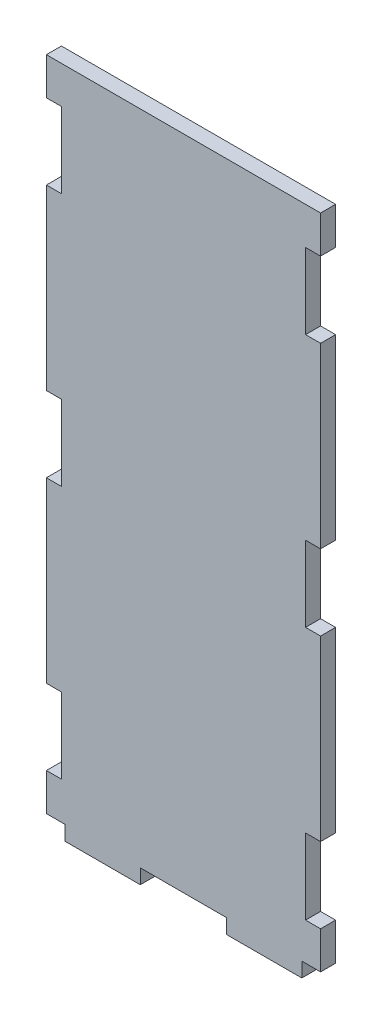
ISO-10303-21;
HEADER;
FILE_DESCRIPTION(('STEP AP214'),'2;1');
FILE_NAME('part.step','',(''),(''),'','','');
FILE_SCHEMA(('AUTOMOTIVE_DESIGN { 1 0 10303 214 1 1 1 1 }'));
ENDSEC;
DATA;
#1=APPLICATION_CONTEXT('core data for automotive mechanical design processes');
#2=APPLICATION_PROTOCOL_DEFINITION('international standard','automotive_design',2000,#1);
#3=PRODUCT_CONTEXT('',#1,'mechanical');
#4=PRODUCT('Part','Part','',(#3));
#5=PRODUCT_RELATED_PRODUCT_CATEGORY('part','',(#4));
#6=PRODUCT_DEFINITION_FORMATION('','',#4);
#7=PRODUCT_DEFINITION_CONTEXT('part definition',#1,'design');
#8=PRODUCT_DEFINITION('design','',#6,#7);
#9=PRODUCT_DEFINITION_SHAPE('','',#8);
#10=(LENGTH_UNIT() NAMED_UNIT(*) SI_UNIT(.MILLI.,.METRE.));
#11=(NAMED_UNIT(*) PLANE_ANGLE_UNIT() SI_UNIT($,.RADIAN.));
#12=(NAMED_UNIT(*) SI_UNIT($,.STERADIAN.) SOLID_ANGLE_UNIT());
#13=UNCERTAINTY_MEASURE_WITH_UNIT(LENGTH_MEASURE(1.E-05),#10,'distance_accuracy_value','');
#14=(GEOMETRIC_REPRESENTATION_CONTEXT(3) GLOBAL_UNCERTAINTY_ASSIGNED_CONTEXT((#13)) GLOBAL_UNIT_ASSIGNED_CONTEXT((#10,
#11,#12)) REPRESENTATION_CONTEXT('',''));
#15=CARTESIAN_POINT('',(0.,0.,0.));
#16=DIRECTION('',(0.,0.,1.));
#17=DIRECTION('',(1.,0.,0.));
#18=AXIS2_PLACEMENT_3D('',#15,#16,#17);
#19=CARTESIAN_POINT('',(0.,77.45,4.));
#20=DIRECTION('',(0.,1.,0.));
#21=DIRECTION('',(0.,0.,1.));
#22=AXIS2_PLACEMENT_3D('',#19,#20,#21);
#23=PLANE('',#22);
#24=DIRECTION('',(1.,0.,0.));
#25=VECTOR('',#24,1.);
#26=CARTESIAN_POINT('',(0.,77.45,0.));
#27=LINE('',#26,#25);
#28=CARTESIAN_POINT('',(-4.,77.45,0.));
#29=VERTEX_POINT('',#28);
#30=CARTESIAN_POINT('',(0.,77.45,0.));
#31=VERTEX_POINT('',#30);
#32=EDGE_CURVE('E303',#29,#31,#27,.T.);
#33=ORIENTED_EDGE('',*,*,#32,.F.);
#34=DIRECTION('',(0.,0.,-1.));
#35=VECTOR('',#34,1.);
#36=CARTESIAN_POINT('',(-4.,77.45,4.));
#37=LINE('',#36,#35);
#38=CARTESIAN_POINT('',(-4.,77.45,4.));
#39=VERTEX_POINT('',#38);
#40=EDGE_CURVE('E11',#39,#29,#37,.T.);
#41=ORIENTED_EDGE('',*,*,#40,.F.);
#42=DIRECTION('',(1.,0.,0.));
#43=VECTOR('',#42,1.);
#44=CARTESIAN_POINT('',(0.,77.45,4.));
#45=LINE('',#44,#43);
#46=CARTESIAN_POINT('',(0.,77.45,4.));
#47=VERTEX_POINT('',#46);
#48=EDGE_CURVE('E627',#39,#47,#45,.T.);
#49=ORIENTED_EDGE('',*,*,#48,.T.);
#50=DIRECTION('',(0.,0.,-1.));
#51=VECTOR('',#50,1.);
#52=CARTESIAN_POINT('',(0.,77.45,4.));
#53=LINE('',#52,#51);
#54=EDGE_CURVE('E176',#47,#31,#53,.T.);
#55=ORIENTED_EDGE('',*,*,#54,.T.);
#56=EDGE_LOOP('',(#33,#41,#49,#55));
#57=FACE_BOUND('',#56,.T.);
#58=ADVANCED_FACE('F41',(#57),#23,.T.);
#59=CARTESIAN_POINT('',(-4.,0.,4.));
#60=DIRECTION('',(-1.,0.,0.));
#61=DIRECTION('',(0.,0.,1.));
#62=AXIS2_PLACEMENT_3D('',#59,#60,#61);
#63=PLANE('',#62);
#64=DIRECTION('',(0.,1.,0.));
#65=VECTOR('',#64,1.);
#66=CARTESIAN_POINT('',(-4.,0.,0.));
#67=LINE('',#66,#65);
#68=CARTESIAN_POINT('',(-4.,97.55,0.));
#69=VERTEX_POINT('',#68);
#70=EDGE_CURVE('E306',#29,#69,#67,.T.);
#71=ORIENTED_EDGE('',*,*,#70,.T.);
#72=DIRECTION('',(0.,0.,-1.));
#73=VECTOR('',#72,1.);
#74=CARTESIAN_POINT('',(-4.,97.55,4.));
#75=LINE('',#74,#73);
#76=CARTESIAN_POINT('',(-4.,97.55,4.));
#77=VERTEX_POINT('',#76);
#78=EDGE_CURVE('E49',#77,#69,#75,.T.);
#79=ORIENTED_EDGE('',*,*,#78,.F.);
#80=DIRECTION('',(0.,1.,0.));
#81=VECTOR('',#80,1.);
#82=CARTESIAN_POINT('',(-4.,0.,4.));
#83=LINE('',#82,#81);
#84=EDGE_CURVE('E477',#39,#77,#83,.T.);
#85=ORIENTED_EDGE('',*,*,#84,.F.);
#86=ORIENTED_EDGE('',*,*,#40,.T.);
#87=EDGE_LOOP('',(#71,#79,#85,#86));
#88=FACE_BOUND('',#87,.T.);
#89=ADVANCED_FACE('F621',(#88),#63,.F.);
#90=CARTESIAN_POINT('',(0.,97.55,4.));
#91=DIRECTION('',(0.,1.,0.));
#92=DIRECTION('',(0.,0.,1.));
#93=AXIS2_PLACEMENT_3D('',#90,#91,#92);
#94=PLANE('',#93);
#95=DIRECTION('',(1.,0.,0.));
#96=VECTOR('',#95,1.);
#97=CARTESIAN_POINT('',(0.,97.55,0.));
#98=LINE('',#97,#96);
#99=CARTESIAN_POINT('',(0.,97.55,0.));
#100=VERTEX_POINT('',#99);
#101=EDGE_CURVE('E308',#69,#100,#98,.T.);
#102=ORIENTED_EDGE('',*,*,#101,.T.);
#103=DIRECTION('',(0.,0.,-1.));
#104=VECTOR('',#103,1.);
#105=CARTESIAN_POINT('',(0.,97.55,4.));
#106=LINE('',#105,#104);
#107=CARTESIAN_POINT('',(0.,97.55,4.));
#108=VERTEX_POINT('',#107);
#109=EDGE_CURVE('E451',#108,#100,#106,.T.);
#110=ORIENTED_EDGE('',*,*,#109,.F.);
#111=DIRECTION('',(1.,0.,0.));
#112=VECTOR('',#111,1.);
#113=CARTESIAN_POINT('',(0.,97.55,4.));
#114=LINE('',#113,#112);
#115=EDGE_CURVE('E460',#77,#108,#114,.T.);
#116=ORIENTED_EDGE('',*,*,#115,.F.);
#117=ORIENTED_EDGE('',*,*,#78,.T.);
#118=EDGE_LOOP('',(#102,#110,#116,#117));
#119=FACE_BOUND('',#118,.T.);
#120=ADVANCED_FACE('F458',(#119),#94,.F.);
#121=CARTESIAN_POINT('',(0.,0.,4.));
#122=DIRECTION('',(-1.,0.,0.));
#123=DIRECTION('',(0.,0.,1.));
#124=AXIS2_PLACEMENT_3D('',#121,#122,#123);
#125=PLANE('',#124);
#126=DIRECTION('',(0.,1.,0.));
#127=VECTOR('',#126,1.);
#128=CARTESIAN_POINT('',(0.,0.,0.));
#129=LINE('',#128,#127);
#130=CARTESIAN_POINT('',(0.,144.95,0.));
#131=VERTEX_POINT('',#130);
#132=EDGE_CURVE('E310',#100,#131,#129,.T.);
#133=ORIENTED_EDGE('',*,*,#132,.T.);
#134=DIRECTION('',(0.,0.,-1.));
#135=VECTOR('',#134,1.);
#136=CARTESIAN_POINT('',(0.,144.95,4.));
#137=LINE('',#136,#135);
#138=CARTESIAN_POINT('',(0.,144.95,4.));
#139=VERTEX_POINT('',#138);
#140=EDGE_CURVE('E449',#139,#131,#137,.T.);
#141=ORIENTED_EDGE('',*,*,#140,.F.);
#142=DIRECTION('',(0.,1.,0.));
#143=VECTOR('',#142,1.);
#144=CARTESIAN_POINT('',(0.,0.,4.));
#145=LINE('',#144,#143);
#146=EDGE_CURVE('E300',#108,#139,#145,.T.);
#147=ORIENTED_EDGE('',*,*,#146,.F.);
#148=ORIENTED_EDGE('',*,*,#109,.T.);
#149=EDGE_LOOP('',(#133,#141,#147,#148));
#150=FACE_BOUND('',#149,.T.);
#151=ADVANCED_FACE('F469',(#150),#125,.F.);
#152=CARTESIAN_POINT('',(0.,144.95,4.));
#153=DIRECTION('',(0.,1.,0.));
#154=DIRECTION('',(0.,0.,1.));
#155=AXIS2_PLACEMENT_3D('',#152,#153,#154);
#156=PLANE('',#155);
#157=DIRECTION('',(1.,0.,0.));
#158=VECTOR('',#157,1.);
#159=CARTESIAN_POINT('',(0.,144.95,0.));
#160=LINE('',#159,#158);
#161=CARTESIAN_POINT('',(-4.00000000000002,144.95,0.));
#162=VERTEX_POINT('',#161);
#163=EDGE_CURVE('E313',#162,#131,#160,.T.);
#164=ORIENTED_EDGE('',*,*,#163,.F.);
#165=DIRECTION('',(0.,0.,-1.));
#166=VECTOR('',#165,1.);
#167=CARTESIAN_POINT('',(-4.00000000000002,144.95,4.));
#168=LINE('',#167,#166);
#169=CARTESIAN_POINT('',(-4.00000000000002,144.95,4.));
#170=VERTEX_POINT('',#169);
#171=EDGE_CURVE('E447',#170,#162,#168,.T.);
#172=ORIENTED_EDGE('',*,*,#171,.F.);
#173=DIRECTION('',(1.,0.,0.));
#174=VECTOR('',#173,1.);
#175=CARTESIAN_POINT('',(0.,144.95,4.));
#176=LINE('',#175,#174);
#177=EDGE_CURVE('E473',#170,#139,#176,.T.);
#178=ORIENTED_EDGE('',*,*,#177,.T.);
#179=ORIENTED_EDGE('',*,*,#140,.T.);
#180=EDGE_LOOP('',(#164,#172,#178,#179));
#181=FACE_BOUND('',#180,.T.);
#182=ADVANCED_FACE('F642',(#181),#156,.T.);
#183=CARTESIAN_POINT('',(-3.99999999999998,0.,4.));
#184=DIRECTION('',(1.,0.,0.));
#185=DIRECTION('',(0.,1.,0.));
#186=AXIS2_PLACEMENT_3D('',#183,#184,#185);
#187=PLANE('',#186);
#188=DIRECTION('',(0.,-1.,0.));
#189=VECTOR('',#188,1.);
#190=CARTESIAN_POINT('',(-3.99999999999998,0.,0.));
#191=LINE('',#190,#189);
#192=CARTESIAN_POINT('',(-4.00000000000002,165.05,0.));
#193=VERTEX_POINT('',#192);
#194=EDGE_CURVE('E318',#193,#162,#191,.T.);
#195=ORIENTED_EDGE('',*,*,#194,.F.);
#196=DIRECTION('',(0.,0.,-1.));
#197=VECTOR('',#196,1.);
#198=CARTESIAN_POINT('',(-4.00000000000002,165.05,4.));
#199=LINE('',#198,#197);
#200=CARTESIAN_POINT('',(-4.00000000000002,165.05,4.));
#201=VERTEX_POINT('',#200);
#202=EDGE_CURVE('E445',#201,#193,#199,.T.);
#203=ORIENTED_EDGE('',*,*,#202,.F.);
#204=DIRECTION('',(0.,-1.,0.));
#205=VECTOR('',#204,1.);
#206=CARTESIAN_POINT('',(-3.99999999999998,0.,4.));
#207=LINE('',#206,#205);
#208=EDGE_CURVE('E475',#201,#170,#207,.T.);
#209=ORIENTED_EDGE('',*,*,#208,.T.);
#210=ORIENTED_EDGE('',*,*,#171,.T.);
#211=EDGE_LOOP('',(#195,#203,#209,#210));
#212=FACE_BOUND('',#211,.T.);
#213=ADVANCED_FACE('F664',(#212),#187,.T.);
#214=CARTESIAN_POINT('',(-1.14526443883989E-12,165.05,4.));
#215=DIRECTION('',(0.,1.,0.));
#216=DIRECTION('',(-1.,0.,0.));
#217=AXIS2_PLACEMENT_3D('',#214,#215,#216);
#218=PLANE('',#217);
#219=DIRECTION('',(1.,0.,0.));
#220=VECTOR('',#219,1.);
#221=CARTESIAN_POINT('',(-1.14526443883989E-12,165.05,0.));
#222=LINE('',#221,#220);
#223=CARTESIAN_POINT('',(0.,165.05,0.));
#224=VERTEX_POINT('',#223);
#225=EDGE_CURVE('E321',#193,#224,#222,.T.);
#226=ORIENTED_EDGE('',*,*,#225,.T.);
#227=DIRECTION('',(0.,0.,-1.));
#228=VECTOR('',#227,1.);
#229=CARTESIAN_POINT('',(0.,165.05,4.));
#230=LINE('',#229,#228);
#231=CARTESIAN_POINT('',(0.,165.05,4.));
#232=VERTEX_POINT('',#231);
#233=EDGE_CURVE('E442',#232,#224,#230,.T.);
#234=ORIENTED_EDGE('',*,*,#233,.F.);
#235=DIRECTION('',(1.,0.,0.));
#236=VECTOR('',#235,1.);
#237=CARTESIAN_POINT('',(-1.14526443883989E-12,165.05,4.));
#238=LINE('',#237,#236);
#239=EDGE_CURVE('E480',#201,#232,#238,.T.);
#240=ORIENTED_EDGE('',*,*,#239,.F.);
#241=ORIENTED_EDGE('',*,*,#202,.T.);
#242=EDGE_LOOP('',(#226,#234,#240,#241));
#243=FACE_BOUND('',#242,.T.);
#244=ADVANCED_FACE('F655',(#243),#218,.F.);
#245=CARTESIAN_POINT('',(0.,175.,0.));
#246=VERTEX_POINT('',#245);
#247=EDGE_CURVE('E315',#224,#246,#129,.T.);
#248=ORIENTED_EDGE('',*,*,#247,.T.);
#249=DIRECTION('',(0.,0.,-1.));
#250=VECTOR('',#249,1.);
#251=CARTESIAN_POINT('',(0.,175.,4.));
#252=LINE('',#251,#250);
#253=CARTESIAN_POINT('',(0.,175.,4.));
#254=VERTEX_POINT('',#253);
#255=EDGE_CURVE('E439',#254,#246,#252,.T.);
#256=ORIENTED_EDGE('',*,*,#255,.F.);
#257=EDGE_CURVE('E474',#232,#254,#145,.T.);
#258=ORIENTED_EDGE('',*,*,#257,.F.);
#259=ORIENTED_EDGE('',*,*,#233,.T.);
#260=EDGE_LOOP('',(#248,#256,#258,#259));
#261=FACE_BOUND('',#260,.T.);
#262=ADVANCED_FACE('F643',(#261),#125,.F.);
#263=CARTESIAN_POINT('',(0.,175.,4.));
#264=DIRECTION('',(0.,-1.,0.));
#265=DIRECTION('',(1.,0.,0.));
#266=AXIS2_PLACEMENT_3D('',#263,#264,#265);
#267=PLANE('',#266);
#268=DIRECTION('',(-1.,0.,0.));
#269=VECTOR('',#268,1.);
#270=CARTESIAN_POINT('',(0.,175.,0.));
#271=LINE('',#270,#269);
#272=CARTESIAN_POINT('',(-73.,175.,0.));
#273=VERTEX_POINT('',#272);
#274=EDGE_CURVE('E323',#246,#273,#271,.T.);
#275=ORIENTED_EDGE('',*,*,#274,.T.);
#276=DIRECTION('',(0.,0.,-1.));
#277=VECTOR('',#276,1.);
#278=CARTESIAN_POINT('',(-73.,175.,4.));
#279=LINE('',#278,#277);
#280=CARTESIAN_POINT('',(-73.,175.,4.));
#281=VERTEX_POINT('',#280);
#282=EDGE_CURVE('E437',#281,#273,#279,.T.);
#283=ORIENTED_EDGE('',*,*,#282,.F.);
#284=DIRECTION('',(-1.,0.,0.));
#285=VECTOR('',#284,1.);
#286=CARTESIAN_POINT('',(0.,175.,4.));
#287=LINE('',#286,#285);
#288=EDGE_CURVE('E479',#254,#281,#287,.T.);
#289=ORIENTED_EDGE('',*,*,#288,.F.);
#290=ORIENTED_EDGE('',*,*,#255,.T.);
#291=EDGE_LOOP('',(#275,#283,#289,#290));
#292=FACE_BOUND('',#291,.T.);
#293=ADVANCED_FACE('F654',(#292),#267,.F.);
#294=CARTESIAN_POINT('',(-73.,0.,4.));
#295=DIRECTION('',(-1.,0.,0.));
#296=DIRECTION('',(0.,-1.,0.));
#297=AXIS2_PLACEMENT_3D('',#294,#295,#296);
#298=PLANE('',#297);
#299=DIRECTION('',(0.,1.,0.));
#300=VECTOR('',#299,1.);
#301=CARTESIAN_POINT('',(-73.,0.,0.));
#302=LINE('',#301,#300);
#303=CARTESIAN_POINT('',(-73.,165.05,0.));
#304=VERTEX_POINT('',#303);
#305=EDGE_CURVE('E326',#304,#273,#302,.T.);
#306=ORIENTED_EDGE('',*,*,#305,.F.);
#307=DIRECTION('',(0.,0.,-1.));
#308=VECTOR('',#307,1.);
#309=CARTESIAN_POINT('',(-73.,165.05,4.));
#310=LINE('',#309,#308);
#311=CARTESIAN_POINT('',(-73.,165.05,4.));
#312=VERTEX_POINT('',#311);
#313=EDGE_CURVE('E435',#312,#304,#310,.T.);
#314=ORIENTED_EDGE('',*,*,#313,.F.);
#315=DIRECTION('',(0.,1.,0.));
#316=VECTOR('',#315,1.);
#317=CARTESIAN_POINT('',(-73.,0.,4.));
#318=LINE('',#317,#316);
#319=EDGE_CURVE('E483',#312,#281,#318,.T.);
#320=ORIENTED_EDGE('',*,*,#319,.T.);
#321=ORIENTED_EDGE('',*,*,#282,.T.);
#322=EDGE_LOOP('',(#306,#314,#320,#321));
#323=FACE_BOUND('',#322,.T.);
#324=ADVANCED_FACE('F661',(#323),#298,.T.);
#325=CARTESIAN_POINT('',(0.,165.05,4.));
#326=DIRECTION('',(0.,-1.,0.));
#327=DIRECTION('',(0.,0.,-1.));
#328=AXIS2_PLACEMENT_3D('',#325,#326,#327);
#329=PLANE('',#328);
#330=DIRECTION('',(-1.,0.,0.));
#331=VECTOR('',#330,1.);
#332=CARTESIAN_POINT('',(0.,165.05,0.));
#333=LINE('',#332,#331);
#334=CARTESIAN_POINT('',(-69.0000000000001,165.05,0.));
#335=VERTEX_POINT('',#334);
#336=EDGE_CURVE('E329',#335,#304,#333,.T.);
#337=ORIENTED_EDGE('',*,*,#336,.F.);
#338=DIRECTION('',(0.,0.,-1.));
#339=VECTOR('',#338,1.);
#340=CARTESIAN_POINT('',(-69.0000000000001,165.05,4.));
#341=LINE('',#340,#339);
#342=CARTESIAN_POINT('',(-69.0000000000001,165.05,4.));
#343=VERTEX_POINT('',#342);
#344=EDGE_CURVE('E433',#343,#335,#341,.T.);
#345=ORIENTED_EDGE('',*,*,#344,.F.);
#346=DIRECTION('',(-1.,0.,0.));
#347=VECTOR('',#346,1.);
#348=CARTESIAN_POINT('',(0.,165.05,4.));
#349=LINE('',#348,#347);
#350=EDGE_CURVE('E523',#343,#312,#349,.T.);
#351=ORIENTED_EDGE('',*,*,#350,.T.);
#352=ORIENTED_EDGE('',*,*,#313,.T.);
#353=EDGE_LOOP('',(#337,#345,#351,#352));
#354=FACE_BOUND('',#353,.T.);
#355=ADVANCED_FACE('F678',(#354),#329,.T.);
#356=CARTESIAN_POINT('',(-69.0000000000001,0.,4.));
#357=DIRECTION('',(1.,0.,0.));
#358=DIRECTION('',(0.,0.,-1.));
#359=AXIS2_PLACEMENT_3D('',#356,#357,#358);
#360=PLANE('',#359);
#361=DIRECTION('',(0.,-1.,0.));
#362=VECTOR('',#361,1.);
#363=CARTESIAN_POINT('',(-69.0000000000001,0.,0.));
#364=LINE('',#363,#362);
#365=CARTESIAN_POINT('',(-69.0000000000001,144.95,0.));
#366=VERTEX_POINT('',#365);
#367=EDGE_CURVE('E334',#335,#366,#364,.T.);
#368=ORIENTED_EDGE('',*,*,#367,.T.);
#369=DIRECTION('',(0.,0.,-1.));
#370=VECTOR('',#369,1.);
#371=CARTESIAN_POINT('',(-69.0000000000001,144.95,4.));
#372=LINE('',#371,#370);
#373=CARTESIAN_POINT('',(-69.0000000000001,144.95,4.));
#374=VERTEX_POINT('',#373);
#375=EDGE_CURVE('E430',#374,#366,#372,.T.);
#376=ORIENTED_EDGE('',*,*,#375,.F.);
#377=DIRECTION('',(0.,-1.,0.));
#378=VECTOR('',#377,1.);
#379=CARTESIAN_POINT('',(-69.0000000000001,0.,4.));
#380=LINE('',#379,#378);
#381=EDGE_CURVE('E527',#343,#374,#380,.T.);
#382=ORIENTED_EDGE('',*,*,#381,.F.);
#383=ORIENTED_EDGE('',*,*,#344,.T.);
#384=EDGE_LOOP('',(#368,#376,#382,#383));
#385=FACE_BOUND('',#384,.T.);
#386=ADVANCED_FACE('F682',(#385),#360,.F.);
#387=CARTESIAN_POINT('',(1.00579267137135E-12,144.949999999999,4.));
#388=DIRECTION('',(0.,-1.,0.));
#389=DIRECTION('',(1.,0.,0.));
#390=AXIS2_PLACEMENT_3D('',#387,#388,#389);
#391=PLANE('',#390);
#392=DIRECTION('',(-1.,0.,0.));
#393=VECTOR('',#392,1.);
#394=CARTESIAN_POINT('',(1.00579267137135E-12,144.949999999999,0.));
#395=LINE('',#394,#393);
#396=CARTESIAN_POINT('',(-73.,144.95,0.));
#397=VERTEX_POINT('',#396);
#398=EDGE_CURVE('E336',#366,#397,#395,.T.);
#399=ORIENTED_EDGE('',*,*,#398,.T.);
#400=DIRECTION('',(0.,0.,-1.));
#401=VECTOR('',#400,1.);
#402=CARTESIAN_POINT('',(-73.,144.95,4.));
#403=LINE('',#402,#401);
#404=CARTESIAN_POINT('',(-73.,144.95,4.));
#405=VERTEX_POINT('',#404);
#406=EDGE_CURVE('E428',#405,#397,#403,.T.);
#407=ORIENTED_EDGE('',*,*,#406,.F.);
#408=DIRECTION('',(-1.,0.,0.));
#409=VECTOR('',#408,1.);
#410=CARTESIAN_POINT('',(1.00579267137135E-12,144.949999999999,4.));
#411=LINE('',#410,#409);
#412=EDGE_CURVE('E530',#374,#405,#411,.T.);
#413=ORIENTED_EDGE('',*,*,#412,.F.);
#414=ORIENTED_EDGE('',*,*,#375,.T.);
#415=EDGE_LOOP('',(#399,#407,#413,#414));
#416=FACE_BOUND('',#415,.T.);
#417=ADVANCED_FACE('F685',(#416),#391,.F.);
#418=CARTESIAN_POINT('',(-73.,97.55,0.));
#419=VERTEX_POINT('',#418);
#420=EDGE_CURVE('E331',#419,#397,#302,.T.);
#421=ORIENTED_EDGE('',*,*,#420,.F.);
#422=DIRECTION('',(0.,0.,-1.));
#423=VECTOR('',#422,1.);
#424=CARTESIAN_POINT('',(-73.,97.55,4.));
#425=LINE('',#424,#423);
#426=CARTESIAN_POINT('',(-73.,97.55,4.));
#427=VERTEX_POINT('',#426);
#428=EDGE_CURVE('E426',#427,#419,#425,.T.);
#429=ORIENTED_EDGE('',*,*,#428,.F.);
#430=EDGE_CURVE('E521',#427,#405,#318,.T.);
#431=ORIENTED_EDGE('',*,*,#430,.T.);
#432=ORIENTED_EDGE('',*,*,#406,.T.);
#433=EDGE_LOOP('',(#421,#429,#431,#432));
#434=FACE_BOUND('',#433,.T.);
#435=ADVANCED_FACE('F688',(#434),#298,.T.);
#436=CARTESIAN_POINT('',(0.,97.55,4.));
#437=DIRECTION('',(0.,-1.,0.));
#438=DIRECTION('',(0.,0.,-1.));
#439=AXIS2_PLACEMENT_3D('',#436,#437,#438);
#440=PLANE('',#439);
#441=DIRECTION('',(-1.,0.,0.));
#442=VECTOR('',#441,1.);
#443=CARTESIAN_POINT('',(0.,97.55,0.));
#444=LINE('',#443,#442);
#445=CARTESIAN_POINT('',(-69.,97.55,0.));
#446=VERTEX_POINT('',#445);
#447=EDGE_CURVE('E339',#446,#419,#444,.T.);
#448=ORIENTED_EDGE('',*,*,#447,.F.);
#449=DIRECTION('',(0.,0.,-1.));
#450=VECTOR('',#449,1.);
#451=CARTESIAN_POINT('',(-69.,97.55,4.));
#452=LINE('',#451,#450);
#453=CARTESIAN_POINT('',(-69.,97.55,4.));
#454=VERTEX_POINT('',#453);
#455=EDGE_CURVE('E424',#454,#446,#452,.T.);
#456=ORIENTED_EDGE('',*,*,#455,.F.);
#457=DIRECTION('',(-1.,0.,0.));
#458=VECTOR('',#457,1.);
#459=CARTESIAN_POINT('',(0.,97.55,4.));
#460=LINE('',#459,#458);
#461=EDGE_CURVE('E529',#454,#427,#460,.T.);
#462=ORIENTED_EDGE('',*,*,#461,.T.);
#463=ORIENTED_EDGE('',*,*,#428,.T.);
#464=EDGE_LOOP('',(#448,#456,#462,#463));
#465=FACE_BOUND('',#464,.T.);
#466=ADVANCED_FACE('F693',(#465),#440,.T.);
#467=CARTESIAN_POINT('',(-69.,0.,4.));
#468=DIRECTION('',(-1.,0.,0.));
#469=DIRECTION('',(0.,0.,1.));
#470=AXIS2_PLACEMENT_3D('',#467,#468,#469);
#471=PLANE('',#470);
#472=DIRECTION('',(0.,1.,0.));
#473=VECTOR('',#472,1.);
#474=CARTESIAN_POINT('',(-69.,0.,0.));
#475=LINE('',#474,#473);
#476=CARTESIAN_POINT('',(-69.,77.45,0.));
#477=VERTEX_POINT('',#476);
#478=EDGE_CURVE('E342',#477,#446,#475,.T.);
#479=ORIENTED_EDGE('',*,*,#478,.F.);
#480=DIRECTION('',(0.,0.,-1.));
#481=VECTOR('',#480,1.);
#482=CARTESIAN_POINT('',(-69.,77.45,4.));
#483=LINE('',#482,#481);
#484=CARTESIAN_POINT('',(-69.,77.45,4.));
#485=VERTEX_POINT('',#484);
#486=EDGE_CURVE('E422',#485,#477,#483,.T.);
#487=ORIENTED_EDGE('',*,*,#486,.F.);
#488=DIRECTION('',(0.,1.,0.));
#489=VECTOR('',#488,1.);
#490=CARTESIAN_POINT('',(-69.,0.,4.));
#491=LINE('',#490,#489);
#492=EDGE_CURVE('E534',#485,#454,#491,.T.);
#493=ORIENTED_EDGE('',*,*,#492,.T.);
#494=ORIENTED_EDGE('',*,*,#455,.T.);
#495=EDGE_LOOP('',(#479,#487,#493,#494));
#496=FACE_BOUND('',#495,.T.);
#497=ADVANCED_FACE('F697',(#496),#471,.T.);
#498=CARTESIAN_POINT('',(0.,77.45,4.));
#499=DIRECTION('',(0.,-1.,0.));
#500=DIRECTION('',(0.,0.,-1.));
#501=AXIS2_PLACEMENT_3D('',#498,#499,#500);
#502=PLANE('',#501);
#503=DIRECTION('',(-1.,0.,0.));
#504=VECTOR('',#503,1.);
#505=CARTESIAN_POINT('',(0.,77.45,0.));
#506=LINE('',#505,#504);
#507=CARTESIAN_POINT('',(-73.,77.45,0.));
#508=VERTEX_POINT('',#507);
#509=EDGE_CURVE('E345',#477,#508,#506,.T.);
#510=ORIENTED_EDGE('',*,*,#509,.T.);
#511=DIRECTION('',(0.,0.,-1.));
#512=VECTOR('',#511,1.);
#513=CARTESIAN_POINT('',(-73.,77.45,4.));
#514=LINE('',#513,#512);
#515=CARTESIAN_POINT('',(-73.,77.45,4.));
#516=VERTEX_POINT('',#515);
#517=EDGE_CURVE('E420',#516,#508,#514,.T.);
#518=ORIENTED_EDGE('',*,*,#517,.F.);
#519=DIRECTION('',(-1.,0.,0.));
#520=VECTOR('',#519,1.);
#521=CARTESIAN_POINT('',(0.,77.45,4.));
#522=LINE('',#521,#520);
#523=EDGE_CURVE('E520',#485,#516,#522,.T.);
#524=ORIENTED_EDGE('',*,*,#523,.F.);
#525=ORIENTED_EDGE('',*,*,#486,.T.);
#526=EDGE_LOOP('',(#510,#518,#524,#525));
#527=FACE_BOUND('',#526,.T.);
#528=ADVANCED_FACE('F701',(#527),#502,.F.);
#529=CARTESIAN_POINT('',(-73.,30.05,0.));
#530=VERTEX_POINT('',#529);
#531=EDGE_CURVE('E348',#530,#508,#302,.T.);
#532=ORIENTED_EDGE('',*,*,#531,.F.);
#533=DIRECTION('',(0.,0.,-1.));
#534=VECTOR('',#533,1.);
#535=CARTESIAN_POINT('',(-73.,30.05,4.));
#536=LINE('',#535,#534);
#537=CARTESIAN_POINT('',(-73.,30.05,4.));
#538=VERTEX_POINT('',#537);
#539=EDGE_CURVE('E418',#538,#530,#536,.T.);
#540=ORIENTED_EDGE('',*,*,#539,.F.);
#541=EDGE_CURVE('E513',#538,#516,#318,.T.);
#542=ORIENTED_EDGE('',*,*,#541,.T.);
#543=ORIENTED_EDGE('',*,*,#517,.T.);
#544=EDGE_LOOP('',(#532,#540,#542,#543));
#545=FACE_BOUND('',#544,.T.);
#546=ADVANCED_FACE('F703',(#545),#298,.T.);
#547=CARTESIAN_POINT('',(0.,30.0500000000001,4.));
#548=DIRECTION('',(0.,-1.,0.));
#549=DIRECTION('',(1.,0.,0.));
#550=AXIS2_PLACEMENT_3D('',#547,#548,#549);
#551=PLANE('',#550);
#552=DIRECTION('',(-1.,0.,0.));
#553=VECTOR('',#552,1.);
#554=CARTESIAN_POINT('',(0.,30.0500000000001,0.));
#555=LINE('',#554,#553);
#556=CARTESIAN_POINT('',(-69.0000000000001,30.05,0.));
#557=VERTEX_POINT('',#556);
#558=EDGE_CURVE('E349',#557,#530,#555,.T.);
#559=ORIENTED_EDGE('',*,*,#558,.F.);
#560=DIRECTION('',(0.,0.,-1.));
#561=VECTOR('',#560,1.);
#562=CARTESIAN_POINT('',(-69.0000000000001,30.05,4.));
#563=LINE('',#562,#561);
#564=CARTESIAN_POINT('',(-69.0000000000001,30.05,4.));
#565=VERTEX_POINT('',#564);
#566=EDGE_CURVE('E416',#565,#557,#563,.T.);
#567=ORIENTED_EDGE('',*,*,#566,.F.);
#568=DIRECTION('',(-1.,0.,0.));
#569=VECTOR('',#568,1.);
#570=CARTESIAN_POINT('',(0.,30.0500000000001,4.));
#571=LINE('',#570,#569);
#572=EDGE_CURVE('E519',#565,#538,#571,.T.);
#573=ORIENTED_EDGE('',*,*,#572,.T.);
#574=ORIENTED_EDGE('',*,*,#539,.T.);
#575=EDGE_LOOP('',(#559,#567,#573,#574));
#576=FACE_BOUND('',#575,.T.);
#577=ADVANCED_FACE('F557',(#576),#551,.T.);
#578=CARTESIAN_POINT('',(-69.0000000000001,0.,4.));
#579=DIRECTION('',(-1.,0.,0.));
#580=DIRECTION('',(0.,0.,1.));
#581=AXIS2_PLACEMENT_3D('',#578,#579,#580);
#582=PLANE('',#581);
#583=DIRECTION('',(0.,1.,0.));
#584=VECTOR('',#583,1.);
#585=CARTESIAN_POINT('',(-69.0000000000001,0.,0.));
#586=LINE('',#585,#584);
#587=CARTESIAN_POINT('',(-69.0000000000001,9.95,0.));
#588=VERTEX_POINT('',#587);
#589=EDGE_CURVE('E352',#588,#557,#586,.T.);
#590=ORIENTED_EDGE('',*,*,#589,.F.);
#591=DIRECTION('',(0.,0.,-1.));
#592=VECTOR('',#591,1.);
#593=CARTESIAN_POINT('',(-69.0000000000001,9.95,4.));
#594=LINE('',#593,#592);
#595=CARTESIAN_POINT('',(-69.0000000000001,9.95,4.));
#596=VERTEX_POINT('',#595);
#597=EDGE_CURVE('E414',#596,#588,#594,.T.);
#598=ORIENTED_EDGE('',*,*,#597,.F.);
#599=DIRECTION('',(0.,1.,0.));
#600=VECTOR('',#599,1.);
#601=CARTESIAN_POINT('',(-69.0000000000001,0.,4.));
#602=LINE('',#601,#600);
#603=EDGE_CURVE('E516',#596,#565,#602,.T.);
#604=ORIENTED_EDGE('',*,*,#603,.T.);
#605=ORIENTED_EDGE('',*,*,#566,.T.);
#606=EDGE_LOOP('',(#590,#598,#604,#605));
#607=FACE_BOUND('',#606,.T.);
#608=ADVANCED_FACE('F550',(#607),#582,.T.);
#609=CARTESIAN_POINT('',(0.,9.94999999999994,4.));
#610=DIRECTION('',(0.,-1.,0.));
#611=DIRECTION('',(1.,0.,0.));
#612=AXIS2_PLACEMENT_3D('',#609,#610,#611);
#613=PLANE('',#612);
#614=DIRECTION('',(-1.,0.,0.));
#615=VECTOR('',#614,1.);
#616=CARTESIAN_POINT('',(0.,9.94999999999994,0.));
#617=LINE('',#616,#615);
#618=CARTESIAN_POINT('',(-73.,9.95,0.));
#619=VERTEX_POINT('',#618);
#620=EDGE_CURVE('E355',#588,#619,#617,.T.);
#621=ORIENTED_EDGE('',*,*,#620,.T.);
#622=DIRECTION('',(0.,0.,-1.));
#623=VECTOR('',#622,1.);
#624=CARTESIAN_POINT('',(-73.,9.95,4.));
#625=LINE('',#624,#623);
#626=CARTESIAN_POINT('',(-73.,9.95,4.));
#627=VERTEX_POINT('',#626);
#628=EDGE_CURVE('E412',#627,#619,#625,.T.);
#629=ORIENTED_EDGE('',*,*,#628,.F.);
#630=DIRECTION('',(-1.,0.,0.));
#631=VECTOR('',#630,1.);
#632=CARTESIAN_POINT('',(0.,9.94999999999994,4.));
#633=LINE('',#632,#631);
#634=EDGE_CURVE('E511',#596,#627,#633,.T.);
#635=ORIENTED_EDGE('',*,*,#634,.F.);
#636=ORIENTED_EDGE('',*,*,#597,.T.);
#637=EDGE_LOOP('',(#621,#629,#635,#636));
#638=FACE_BOUND('',#637,.T.);
#639=ADVANCED_FACE('F564',(#638),#613,.F.);
#640=CARTESIAN_POINT('',(-73.,0.,0.));
#641=VERTEX_POINT('',#640);
#642=EDGE_CURVE('E330',#641,#619,#302,.T.);
#643=ORIENTED_EDGE('',*,*,#642,.F.);
#644=DIRECTION('',(0.,0.,-1.));
#645=VECTOR('',#644,1.);
#646=CARTESIAN_POINT('',(-73.,0.,4.));
#647=LINE('',#646,#645);
#648=CARTESIAN_POINT('',(-73.,0.,4.));
#649=VERTEX_POINT('',#648);
#650=EDGE_CURVE('E410',#649,#641,#647,.T.);
#651=ORIENTED_EDGE('',*,*,#650,.F.);
#652=EDGE_CURVE('E506',#649,#627,#318,.T.);
#653=ORIENTED_EDGE('',*,*,#652,.T.);
#654=ORIENTED_EDGE('',*,*,#628,.T.);
#655=EDGE_LOOP('',(#643,#651,#653,#654));
#656=FACE_BOUND('',#655,.T.);
#657=ADVANCED_FACE('F565',(#656),#298,.T.);
#658=CARTESIAN_POINT('',(0.,0.,4.));
#659=DIRECTION('',(0.,-1.,0.));
#660=DIRECTION('',(1.,0.,0.));
#661=AXIS2_PLACEMENT_3D('',#658,#659,#660);
#662=PLANE('',#661);
#663=DIRECTION('',(-1.,0.,0.));
#664=VECTOR('',#663,1.);
#665=CARTESIAN_POINT('',(0.,0.,0.));
#666=LINE('',#665,#664);
#667=CARTESIAN_POINT('',(-68.,0.,0.));
#668=VERTEX_POINT('',#667);
#669=EDGE_CURVE('E358',#668,#641,#666,.T.);
#670=ORIENTED_EDGE('',*,*,#669,.F.);
#671=DIRECTION('',(0.,0.,-1.));
#672=VECTOR('',#671,1.);
#673=CARTESIAN_POINT('',(-68.,0.,4.));
#674=LINE('',#673,#672);
#675=CARTESIAN_POINT('',(-68.,0.,4.));
#676=VERTEX_POINT('',#675);
#677=EDGE_CURVE('E408',#676,#668,#674,.T.);
#678=ORIENTED_EDGE('',*,*,#677,.F.);
#679=DIRECTION('',(-1.,0.,0.));
#680=VECTOR('',#679,1.);
#681=CARTESIAN_POINT('',(0.,0.,4.));
#682=LINE('',#681,#680);
#683=EDGE_CURVE('E494',#676,#649,#682,.T.);
#684=ORIENTED_EDGE('',*,*,#683,.T.);
#685=ORIENTED_EDGE('',*,*,#650,.T.);
#686=EDGE_LOOP('',(#670,#678,#684,#685));
#687=FACE_BOUND('',#686,.T.);
#688=ADVANCED_FACE('F569',(#687),#662,.T.);
#689=CARTESIAN_POINT('',(-68.,0.,4.));
#690=DIRECTION('',(1.,0.,0.));
#691=DIRECTION('',(0.,0.,-1.));
#692=AXIS2_PLACEMENT_3D('',#689,#690,#691);
#693=PLANE('',#692);
#694=DIRECTION('',(0.,-1.,0.));
#695=VECTOR('',#694,1.);
#696=CARTESIAN_POINT('',(-68.,0.,0.));
#697=LINE('',#696,#695);
#698=CARTESIAN_POINT('',(-68.,-3.9,0.));
#699=VERTEX_POINT('',#698);
#700=EDGE_CURVE('E361',#668,#699,#697,.T.);
#701=ORIENTED_EDGE('',*,*,#700,.T.);
#702=DIRECTION('',(0.,0.,-1.));
#703=VECTOR('',#702,1.);
#704=CARTESIAN_POINT('',(-68.,-3.9,4.));
#705=LINE('',#704,#703);
#706=CARTESIAN_POINT('',(-68.,-3.9,4.));
#707=VERTEX_POINT('',#706);
#708=EDGE_CURVE('E405',#707,#699,#705,.T.);
#709=ORIENTED_EDGE('',*,*,#708,.F.);
#710=DIRECTION('',(0.,-1.,0.));
#711=VECTOR('',#710,1.);
#712=CARTESIAN_POINT('',(-68.,0.,4.));
#713=LINE('',#712,#711);
#714=EDGE_CURVE('E505',#676,#707,#713,.T.);
#715=ORIENTED_EDGE('',*,*,#714,.F.);
#716=ORIENTED_EDGE('',*,*,#677,.T.);
#717=EDGE_LOOP('',(#701,#709,#715,#716));
#718=FACE_BOUND('',#717,.T.);
#719=ADVANCED_FACE('F573',(#718),#693,.F.);
#720=CARTESIAN_POINT('',(0.,-3.89999999999999,4.));
#721=DIRECTION('',(0.,1.,0.));
#722=DIRECTION('',(-1.,0.,0.));
#723=AXIS2_PLACEMENT_3D('',#720,#721,#722);
#724=PLANE('',#723);
#725=DIRECTION('',(1.,0.,0.));
#726=VECTOR('',#725,1.);
#727=CARTESIAN_POINT('',(0.,-3.89999999999999,0.));
#728=LINE('',#727,#726);
#729=CARTESIAN_POINT('',(-48.,-3.9,0.));
#730=VERTEX_POINT('',#729);
#731=EDGE_CURVE('E365',#699,#730,#728,.T.);
#732=ORIENTED_EDGE('',*,*,#731,.T.);
#733=DIRECTION('',(0.,0.,-1.));
#734=VECTOR('',#733,1.);
#735=CARTESIAN_POINT('',(-48.,-3.9,4.));
#736=LINE('',#735,#734);
#737=CARTESIAN_POINT('',(-48.,-3.9,4.));
#738=VERTEX_POINT('',#737);
#739=EDGE_CURVE('E403',#738,#730,#736,.T.);
#740=ORIENTED_EDGE('',*,*,#739,.F.);
#741=DIRECTION('',(1.,0.,0.));
#742=VECTOR('',#741,1.);
#743=CARTESIAN_POINT('',(0.,-3.89999999999999,4.));
#744=LINE('',#743,#742);
#745=EDGE_CURVE('E509',#707,#738,#744,.T.);
#746=ORIENTED_EDGE('',*,*,#745,.F.);
#747=ORIENTED_EDGE('',*,*,#708,.T.);
#748=EDGE_LOOP('',(#732,#740,#746,#747));
#749=FACE_BOUND('',#748,.T.);
#750=ADVANCED_FACE('F581',(#749),#724,.F.);
#751=CARTESIAN_POINT('',(-48.,0.,4.));
#752=DIRECTION('',(1.,0.,0.));
#753=DIRECTION('',(0.,0.,-1.));
#754=AXIS2_PLACEMENT_3D('',#751,#752,#753);
#755=PLANE('',#754);
#756=DIRECTION('',(0.,-1.,0.));
#757=VECTOR('',#756,1.);
#758=CARTESIAN_POINT('',(-48.,0.,0.));
#759=LINE('',#758,#757);
#760=CARTESIAN_POINT('',(-48.,0.,0.));
#761=VERTEX_POINT('',#760);
#762=EDGE_CURVE('E368',#761,#730,#759,.T.);
#763=ORIENTED_EDGE('',*,*,#762,.F.);
#764=DIRECTION('',(0.,0.,-1.));
#765=VECTOR('',#764,1.);
#766=CARTESIAN_POINT('',(-48.,0.,4.));
#767=LINE('',#766,#765);
#768=CARTESIAN_POINT('',(-48.,0.,4.));
#769=VERTEX_POINT('',#768);
#770=EDGE_CURVE('E401',#769,#761,#767,.T.);
#771=ORIENTED_EDGE('',*,*,#770,.F.);
#772=DIRECTION('',(0.,-1.,0.));
#773=VECTOR('',#772,1.);
#774=CARTESIAN_POINT('',(-48.,0.,4.));
#775=LINE('',#774,#773);
#776=EDGE_CURVE('E503',#769,#738,#775,.T.);
#777=ORIENTED_EDGE('',*,*,#776,.T.);
#778=ORIENTED_EDGE('',*,*,#739,.T.);
#779=EDGE_LOOP('',(#763,#771,#777,#778));
#780=FACE_BOUND('',#779,.T.);
#781=ADVANCED_FACE('F584',(#780),#755,.T.);
#782=CARTESIAN_POINT('',(-25.,0.,0.));
#783=VERTEX_POINT('',#782);
#784=EDGE_CURVE('E363',#783,#761,#666,.T.);
#785=ORIENTED_EDGE('',*,*,#784,.F.);
#786=DIRECTION('',(0.,0.,-1.));
#787=VECTOR('',#786,1.);
#788=CARTESIAN_POINT('',(-25.,0.,4.));
#789=LINE('',#788,#787);
#790=CARTESIAN_POINT('',(-25.,0.,4.));
#791=VERTEX_POINT('',#790);
#792=EDGE_CURVE('E399',#791,#783,#789,.T.);
#793=ORIENTED_EDGE('',*,*,#792,.F.);
#794=EDGE_CURVE('E493',#791,#769,#682,.T.);
#795=ORIENTED_EDGE('',*,*,#794,.T.);
#796=ORIENTED_EDGE('',*,*,#770,.T.);
#797=EDGE_LOOP('',(#785,#793,#795,#796));
#798=FACE_BOUND('',#797,.T.);
#799=ADVANCED_FACE('F608',(#798),#662,.T.);
#800=CARTESIAN_POINT('',(-25.,0.,4.));
#801=DIRECTION('',(1.,0.,0.));
#802=DIRECTION('',(0.,0.,-1.));
#803=AXIS2_PLACEMENT_3D('',#800,#801,#802);
#804=PLANE('',#803);
#805=DIRECTION('',(0.,-1.,0.));
#806=VECTOR('',#805,1.);
#807=CARTESIAN_POINT('',(-25.,0.,0.));
#808=LINE('',#807,#806);
#809=CARTESIAN_POINT('',(-25.,-3.9,0.));
#810=VERTEX_POINT('',#809);
#811=EDGE_CURVE('E371',#783,#810,#808,.T.);
#812=ORIENTED_EDGE('',*,*,#811,.T.);
#813=DIRECTION('',(0.,0.,-1.));
#814=VECTOR('',#813,1.);
#815=CARTESIAN_POINT('',(-25.,-3.9,4.));
#816=LINE('',#815,#814);
#817=CARTESIAN_POINT('',(-25.,-3.9,4.));
#818=VERTEX_POINT('',#817);
#819=EDGE_CURVE('E397',#818,#810,#816,.T.);
#820=ORIENTED_EDGE('',*,*,#819,.F.);
#821=DIRECTION('',(0.,-1.,0.));
#822=VECTOR('',#821,1.);
#823=CARTESIAN_POINT('',(-25.,0.,4.));
#824=LINE('',#823,#822);
#825=EDGE_CURVE('E502',#791,#818,#824,.T.);
#826=ORIENTED_EDGE('',*,*,#825,.F.);
#827=ORIENTED_EDGE('',*,*,#792,.T.);
#828=EDGE_LOOP('',(#812,#820,#826,#827));
#829=FACE_BOUND('',#828,.T.);
#830=ADVANCED_FACE('F610',(#829),#804,.F.);
#831=CARTESIAN_POINT('',(0.,-3.9,4.));
#832=DIRECTION('',(0.,-1.,0.));
#833=DIRECTION('',(1.,0.,0.));
#834=AXIS2_PLACEMENT_3D('',#831,#832,#833);
#835=PLANE('',#834);
#836=DIRECTION('',(-1.,0.,0.));
#837=VECTOR('',#836,1.);
#838=CARTESIAN_POINT('',(0.,-3.9,0.));
#839=LINE('',#838,#837);
#840=CARTESIAN_POINT('',(-5.00000000000002,-3.9,0.));
#841=VERTEX_POINT('',#840);
#842=EDGE_CURVE('E374',#841,#810,#839,.T.);
#843=ORIENTED_EDGE('',*,*,#842,.F.);
#844=DIRECTION('',(0.,0.,-1.));
#845=VECTOR('',#844,1.);
#846=CARTESIAN_POINT('',(-5.00000000000002,-3.9,4.));
#847=LINE('',#846,#845);
#848=CARTESIAN_POINT('',(-5.00000000000002,-3.9,4.));
#849=VERTEX_POINT('',#848);
#850=EDGE_CURVE('E395',#849,#841,#847,.T.);
#851=ORIENTED_EDGE('',*,*,#850,.F.);
#852=DIRECTION('',(-1.,0.,0.));
#853=VECTOR('',#852,1.);
#854=CARTESIAN_POINT('',(0.,-3.9,4.));
#855=LINE('',#854,#853);
#856=EDGE_CURVE('E497',#849,#818,#855,.T.);
#857=ORIENTED_EDGE('',*,*,#856,.T.);
#858=ORIENTED_EDGE('',*,*,#819,.T.);
#859=EDGE_LOOP('',(#843,#851,#857,#858));
#860=FACE_BOUND('',#859,.T.);
#861=ADVANCED_FACE('F592',(#860),#835,.T.);
#862=CARTESIAN_POINT('',(-5.00000000000002,0.,4.));
#863=DIRECTION('',(1.,0.,0.));
#864=DIRECTION('',(0.,0.,-1.));
#865=AXIS2_PLACEMENT_3D('',#862,#863,#864);
#866=PLANE('',#865);
#867=DIRECTION('',(0.,-1.,0.));
#868=VECTOR('',#867,1.);
#869=CARTESIAN_POINT('',(-5.00000000000002,0.,0.));
#870=LINE('',#869,#868);
#871=CARTESIAN_POINT('',(-5.00000000000002,0.,0.));
#872=VERTEX_POINT('',#871);
#873=EDGE_CURVE('E377',#872,#841,#870,.T.);
#874=ORIENTED_EDGE('',*,*,#873,.F.);
#875=DIRECTION('',(0.,0.,-1.));
#876=VECTOR('',#875,1.);
#877=CARTESIAN_POINT('',(-5.00000000000002,0.,4.));
#878=LINE('',#877,#876);
#879=CARTESIAN_POINT('',(-5.00000000000002,0.,4.));
#880=VERTEX_POINT('',#879);
#881=EDGE_CURVE('E393',#880,#872,#878,.T.);
#882=ORIENTED_EDGE('',*,*,#881,.F.);
#883=DIRECTION('',(0.,-1.,0.));
#884=VECTOR('',#883,1.);
#885=CARTESIAN_POINT('',(-5.00000000000002,0.,4.));
#886=LINE('',#885,#884);
#887=EDGE_CURVE('E491',#880,#849,#886,.T.);
#888=ORIENTED_EDGE('',*,*,#887,.T.);
#889=ORIENTED_EDGE('',*,*,#850,.T.);
#890=EDGE_LOOP('',(#874,#882,#888,#889));
#891=FACE_BOUND('',#890,.T.);
#892=ADVANCED_FACE('F598',(#891),#866,.T.);
#893=CARTESIAN_POINT('',(0.,0.,0.));
#894=VERTEX_POINT('',#893);
#895=EDGE_CURVE('E362',#894,#872,#666,.T.);
#896=ORIENTED_EDGE('',*,*,#895,.F.);
#897=DIRECTION('',(0.,0.,-1.));
#898=VECTOR('',#897,1.);
#899=CARTESIAN_POINT('',(0.,0.,4.));
#900=LINE('',#899,#898);
#901=CARTESIAN_POINT('',(0.,0.,4.));
#902=VERTEX_POINT('',#901);
#903=EDGE_CURVE('E391',#902,#894,#900,.T.);
#904=ORIENTED_EDGE('',*,*,#903,.F.);
#905=EDGE_CURVE('E486',#902,#880,#682,.T.);
#906=ORIENTED_EDGE('',*,*,#905,.T.);
#907=ORIENTED_EDGE('',*,*,#881,.T.);
#908=EDGE_LOOP('',(#896,#904,#906,#907));
#909=FACE_BOUND('',#908,.T.);
#910=ADVANCED_FACE('F601',(#909),#662,.T.);
#911=CARTESIAN_POINT('',(0.,9.95,0.));
#912=VERTEX_POINT('',#911);
#913=EDGE_CURVE('E383',#894,#912,#129,.T.);
#914=ORIENTED_EDGE('',*,*,#913,.T.);
#915=DIRECTION('',(0.,0.,-1.));
#916=VECTOR('',#915,1.);
#917=CARTESIAN_POINT('',(0.,9.95,4.));
#918=LINE('',#917,#916);
#919=CARTESIAN_POINT('',(0.,9.95,4.));
#920=VERTEX_POINT('',#919);
#921=EDGE_CURVE('E389',#920,#912,#918,.T.);
#922=ORIENTED_EDGE('',*,*,#921,.F.);
#923=EDGE_CURVE('E299',#902,#920,#145,.T.);
#924=ORIENTED_EDGE('',*,*,#923,.F.);
#925=ORIENTED_EDGE('',*,*,#903,.T.);
#926=EDGE_LOOP('',(#914,#922,#924,#925));
#927=FACE_BOUND('',#926,.T.);
#928=ADVANCED_FACE('F633',(#927),#125,.F.);
#929=CARTESIAN_POINT('',(0.,9.95,4.));
#930=DIRECTION('',(0.,1.,0.));
#931=DIRECTION('',(-1.,0.,0.));
#932=AXIS2_PLACEMENT_3D('',#929,#930,#931);
#933=PLANE('',#932);
#934=DIRECTION('',(1.,0.,0.));
#935=VECTOR('',#934,1.);
#936=CARTESIAN_POINT('',(0.,9.95,0.));
#937=LINE('',#936,#935);
#938=CARTESIAN_POINT('',(-4.,9.95,0.));
#939=VERTEX_POINT('',#938);
#940=EDGE_CURVE('E380',#939,#912,#937,.T.);
#941=ORIENTED_EDGE('',*,*,#940,.F.);
#942=DIRECTION('',(0.,0.,-1.));
#943=VECTOR('',#942,1.);
#944=CARTESIAN_POINT('',(-4.,9.95,4.));
#945=LINE('',#944,#943);
#946=CARTESIAN_POINT('',(-4.,9.95,4.));
#947=VERTEX_POINT('',#946);
#948=EDGE_CURVE('E293',#947,#939,#945,.T.);
#949=ORIENTED_EDGE('',*,*,#948,.F.);
#950=DIRECTION('',(1.,0.,0.));
#951=VECTOR('',#950,1.);
#952=CARTESIAN_POINT('',(0.,9.95,4.));
#953=LINE('',#952,#951);
#954=EDGE_CURVE('E286',#947,#920,#953,.T.);
#955=ORIENTED_EDGE('',*,*,#954,.T.);
#956=ORIENTED_EDGE('',*,*,#921,.T.);
#957=EDGE_LOOP('',(#941,#949,#955,#956));
#958=FACE_BOUND('',#957,.T.);
#959=ADVANCED_FACE('F645',(#958),#933,.T.);
#960=CARTESIAN_POINT('',(-4.,0.,4.));
#961=DIRECTION('',(-1.,0.,0.));
#962=DIRECTION('',(0.,0.,1.));
#963=AXIS2_PLACEMENT_3D('',#960,#961,#962);
#964=PLANE('',#963);
#965=DIRECTION('',(0.,1.,0.));
#966=VECTOR('',#965,1.);
#967=CARTESIAN_POINT('',(-4.,0.,0.));
#968=LINE('',#967,#966);
#969=CARTESIAN_POINT('',(-4.,30.05,0.));
#970=VERTEX_POINT('',#969);
#971=EDGE_CURVE('E292',#939,#970,#968,.T.);
#972=ORIENTED_EDGE('',*,*,#971,.T.);
#973=DIRECTION('',(0.,0.,-1.));
#974=VECTOR('',#973,1.);
#975=CARTESIAN_POINT('',(-4.,30.05,4.));
#976=LINE('',#975,#974);
#977=CARTESIAN_POINT('',(-4.,30.05,4.));
#978=VERTEX_POINT('',#977);
#979=EDGE_CURVE('E289',#978,#970,#976,.T.);
#980=ORIENTED_EDGE('',*,*,#979,.F.);
#981=DIRECTION('',(0.,1.,0.));
#982=VECTOR('',#981,1.);
#983=CARTESIAN_POINT('',(-4.,0.,4.));
#984=LINE('',#983,#982);
#985=EDGE_CURVE('E280',#947,#978,#984,.T.);
#986=ORIENTED_EDGE('',*,*,#985,.F.);
#987=ORIENTED_EDGE('',*,*,#948,.T.);
#988=EDGE_LOOP('',(#972,#980,#986,#987));
#989=FACE_BOUND('',#988,.T.);
#990=ADVANCED_FACE('F290',(#989),#964,.F.);
#991=CARTESIAN_POINT('',(0.,30.05,4.));
#992=DIRECTION('',(0.,1.,0.));
#993=DIRECTION('',(-1.,0.,0.));
#994=AXIS2_PLACEMENT_3D('',#991,#992,#993);
#995=PLANE('',#994);
#996=DIRECTION('',(1.,0.,0.));
#997=VECTOR('',#996,1.);
#998=CARTESIAN_POINT('',(0.,30.05,0.));
#999=LINE('',#998,#997);
#1000=CARTESIAN_POINT('',(0.,30.05,0.));
#1001=VERTEX_POINT('',#1000);
#1002=EDGE_CURVE('E169',#970,#1001,#999,.T.);
#1003=ORIENTED_EDGE('',*,*,#1002,.T.);
#1004=DIRECTION('',(0.,0.,-1.));
#1005=VECTOR('',#1004,1.);
#1006=CARTESIAN_POINT('',(0.,30.05,4.));
#1007=LINE('',#1006,#1005);
#1008=CARTESIAN_POINT('',(0.,30.05,4.));
#1009=VERTEX_POINT('',#1008);
#1010=EDGE_CURVE('E294',#1009,#1001,#1007,.T.);
#1011=ORIENTED_EDGE('',*,*,#1010,.F.);
#1012=DIRECTION('',(1.,0.,0.));
#1013=VECTOR('',#1012,1.);
#1014=CARTESIAN_POINT('',(0.,30.05,4.));
#1015=LINE('',#1014,#1013);
#1016=EDGE_CURVE('E284',#978,#1009,#1015,.T.);
#1017=ORIENTED_EDGE('',*,*,#1016,.F.);
#1018=ORIENTED_EDGE('',*,*,#979,.T.);
#1019=EDGE_LOOP('',(#1003,#1011,#1017,#1018));
#1020=FACE_BOUND('',#1019,.T.);
#1021=ADVANCED_FACE('F296',(#1020),#995,.F.);
#1022=EDGE_CURVE('E314',#1001,#31,#129,.T.);
#1023=ORIENTED_EDGE('',*,*,#1022,.T.);
#1024=ORIENTED_EDGE('',*,*,#54,.F.);
#1025=EDGE_CURVE('E57',#1009,#47,#145,.T.);
#1026=ORIENTED_EDGE('',*,*,#1025,.F.);
#1027=ORIENTED_EDGE('',*,*,#1010,.T.);
#1028=EDGE_LOOP('',(#1023,#1024,#1026,#1027));
#1029=FACE_BOUND('',#1028,.T.);
#1030=ADVANCED_FACE('F630',(#1029),#125,.F.);
#1031=CARTESIAN_POINT('',(0.,0.,4.));
#1032=DIRECTION('',(0.,0.,1.));
#1033=DIRECTION('',(1.,0.,0.));
#1034=AXIS2_PLACEMENT_3D('',#1031,#1032,#1033);
#1035=PLANE('',#1034);
#1036=ORIENTED_EDGE('',*,*,#48,.F.);
#1037=ORIENTED_EDGE('',*,*,#84,.T.);
#1038=ORIENTED_EDGE('',*,*,#115,.T.);
#1039=ORIENTED_EDGE('',*,*,#146,.T.);
#1040=ORIENTED_EDGE('',*,*,#177,.F.);
#1041=ORIENTED_EDGE('',*,*,#208,.F.);
#1042=ORIENTED_EDGE('',*,*,#239,.T.);
#1043=ORIENTED_EDGE('',*,*,#257,.T.);
#1044=ORIENTED_EDGE('',*,*,#288,.T.);
#1045=ORIENTED_EDGE('',*,*,#319,.F.);
#1046=ORIENTED_EDGE('',*,*,#350,.F.);
#1047=ORIENTED_EDGE('',*,*,#381,.T.);
#1048=ORIENTED_EDGE('',*,*,#412,.T.);
#1049=ORIENTED_EDGE('',*,*,#430,.F.);
#1050=ORIENTED_EDGE('',*,*,#461,.F.);
#1051=ORIENTED_EDGE('',*,*,#492,.F.);
#1052=ORIENTED_EDGE('',*,*,#523,.T.);
#1053=ORIENTED_EDGE('',*,*,#541,.F.);
#1054=ORIENTED_EDGE('',*,*,#572,.F.);
#1055=ORIENTED_EDGE('',*,*,#603,.F.);
#1056=ORIENTED_EDGE('',*,*,#634,.T.);
#1057=ORIENTED_EDGE('',*,*,#652,.F.);
#1058=ORIENTED_EDGE('',*,*,#683,.F.);
#1059=ORIENTED_EDGE('',*,*,#714,.T.);
#1060=ORIENTED_EDGE('',*,*,#745,.T.);
#1061=ORIENTED_EDGE('',*,*,#776,.F.);
#1062=ORIENTED_EDGE('',*,*,#794,.F.);
#1063=ORIENTED_EDGE('',*,*,#825,.T.);
#1064=ORIENTED_EDGE('',*,*,#856,.F.);
#1065=ORIENTED_EDGE('',*,*,#887,.F.);
#1066=ORIENTED_EDGE('',*,*,#905,.F.);
#1067=ORIENTED_EDGE('',*,*,#923,.T.);
#1068=ORIENTED_EDGE('',*,*,#954,.F.);
#1069=ORIENTED_EDGE('',*,*,#985,.T.);
#1070=ORIENTED_EDGE('',*,*,#1016,.T.);
#1071=ORIENTED_EDGE('',*,*,#1025,.T.);
#1072=EDGE_LOOP('',(#1036,#1037,#1038,#1039,#1040,#1041,#1042,#1043,#1044,#1045,#1046,#1047,
#1048,#1049,#1050,#1051,#1052,#1053,#1054,#1055,#1056,#1057,#1058,#1059,#1060,#1061,#1062,#1063,
#1064,#1065,#1066,#1067,#1068,#1069,#1070,#1071));
#1073=FACE_BOUND('',#1072,.T.);
#1074=ADVANCED_FACE('F282',(#1073),#1035,.T.);
#1075=CARTESIAN_POINT('',(0.,0.,0.));
#1076=DIRECTION('',(0.,0.,1.));
#1077=DIRECTION('',(1.,0.,0.));
#1078=AXIS2_PLACEMENT_3D('',#1075,#1076,#1077);
#1079=PLANE('',#1078);
#1080=ORIENTED_EDGE('',*,*,#32,.T.);
#1081=ORIENTED_EDGE('',*,*,#1022,.F.);
#1082=ORIENTED_EDGE('',*,*,#1002,.F.);
#1083=ORIENTED_EDGE('',*,*,#971,.F.);
#1084=ORIENTED_EDGE('',*,*,#940,.T.);
#1085=ORIENTED_EDGE('',*,*,#913,.F.);
#1086=ORIENTED_EDGE('',*,*,#895,.T.);
#1087=ORIENTED_EDGE('',*,*,#873,.T.);
#1088=ORIENTED_EDGE('',*,*,#842,.T.);
#1089=ORIENTED_EDGE('',*,*,#811,.F.);
#1090=ORIENTED_EDGE('',*,*,#784,.T.);
#1091=ORIENTED_EDGE('',*,*,#762,.T.);
#1092=ORIENTED_EDGE('',*,*,#731,.F.);
#1093=ORIENTED_EDGE('',*,*,#700,.F.);
#1094=ORIENTED_EDGE('',*,*,#669,.T.);
#1095=ORIENTED_EDGE('',*,*,#642,.T.);
#1096=ORIENTED_EDGE('',*,*,#620,.F.);
#1097=ORIENTED_EDGE('',*,*,#589,.T.);
#1098=ORIENTED_EDGE('',*,*,#558,.T.);
#1099=ORIENTED_EDGE('',*,*,#531,.T.);
#1100=ORIENTED_EDGE('',*,*,#509,.F.);
#1101=ORIENTED_EDGE('',*,*,#478,.T.);
#1102=ORIENTED_EDGE('',*,*,#447,.T.);
#1103=ORIENTED_EDGE('',*,*,#420,.T.);
#1104=ORIENTED_EDGE('',*,*,#398,.F.);
#1105=ORIENTED_EDGE('',*,*,#367,.F.);
#1106=ORIENTED_EDGE('',*,*,#336,.T.);
#1107=ORIENTED_EDGE('',*,*,#305,.T.);
#1108=ORIENTED_EDGE('',*,*,#274,.F.);
#1109=ORIENTED_EDGE('',*,*,#247,.F.);
#1110=ORIENTED_EDGE('',*,*,#225,.F.);
#1111=ORIENTED_EDGE('',*,*,#194,.T.);
#1112=ORIENTED_EDGE('',*,*,#163,.T.);
#1113=ORIENTED_EDGE('',*,*,#132,.F.);
#1114=ORIENTED_EDGE('',*,*,#101,.F.);
#1115=ORIENTED_EDGE('',*,*,#70,.F.);
#1116=EDGE_LOOP('',(#1080,#1081,#1082,#1083,#1084,#1085,#1086,#1087,#1088,#1089,#1090,#1091,
#1092,#1093,#1094,#1095,#1096,#1097,#1098,#1099,#1100,#1101,#1102,#1103,#1104,#1105,#1106,#1107,
#1108,#1109,#1110,#1111,#1112,#1113,#1114,#1115));
#1117=FACE_BOUND('',#1116,.T.);
#1118=ADVANCED_FACE('F465',(#1117),#1079,.F.);
#1119=CLOSED_SHELL('',(#58,#89,#120,#151,#182,#213,#244,#262,#293,#324,#355,#386,#417,#435,#466,
#497,#528,#546,#577,#608,#639,#657,#688,#719,#750,#781,#799,#830,#861,#892,#910,#928,#959,#990,
#1021,#1030,#1074,#1118));
#1120=MANIFOLD_SOLID_BREP('B2',#1119);
#1121=ADVANCED_BREP_SHAPE_REPRESENTATION('',(#18,#1120),#14);
#1122=SHAPE_DEFINITION_REPRESENTATION(#9,#1121);
ENDSEC;
END-ISO-10303-21;
